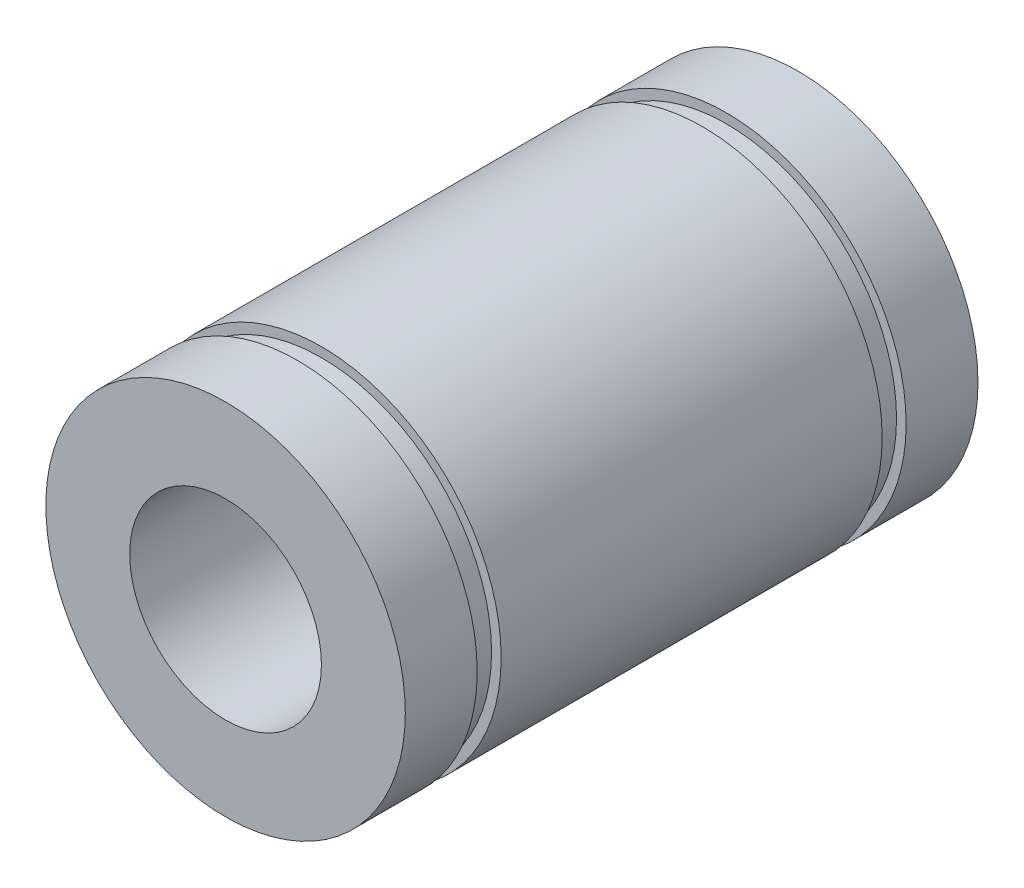
ISO-10303-21;
HEADER;
FILE_DESCRIPTION(('STEP AP214'),'2;1');
FILE_NAME('part.step','',(''),(''),'','','');
FILE_SCHEMA(('AUTOMOTIVE_DESIGN { 1 0 10303 214 1 1 1 1 }'));
ENDSEC;
DATA;
#1=APPLICATION_CONTEXT('core data for automotive mechanical design processes');
#2=APPLICATION_PROTOCOL_DEFINITION('international standard','automotive_design',2000,#1);
#3=PRODUCT_CONTEXT('',#1,'mechanical');
#4=PRODUCT('Part','Part','',(#3));
#5=PRODUCT_RELATED_PRODUCT_CATEGORY('part','',(#4));
#6=PRODUCT_DEFINITION_FORMATION('','',#4);
#7=PRODUCT_DEFINITION_CONTEXT('part definition',#1,'design');
#8=PRODUCT_DEFINITION('design','',#6,#7);
#9=PRODUCT_DEFINITION_SHAPE('','',#8);
#10=(LENGTH_UNIT() NAMED_UNIT(*) SI_UNIT(.MILLI.,.METRE.));
#11=(NAMED_UNIT(*) PLANE_ANGLE_UNIT() SI_UNIT($,.RADIAN.));
#12=(NAMED_UNIT(*) SI_UNIT($,.STERADIAN.) SOLID_ANGLE_UNIT());
#13=UNCERTAINTY_MEASURE_WITH_UNIT(LENGTH_MEASURE(1.E-05),#10,'distance_accuracy_value','');
#14=(GEOMETRIC_REPRESENTATION_CONTEXT(3) GLOBAL_UNCERTAINTY_ASSIGNED_CONTEXT((#13)) GLOBAL_UNIT_ASSIGNED_CONTEXT((#10,
#11,#12)) REPRESENTATION_CONTEXT('',''));
#15=CARTESIAN_POINT('',(0.,0.,0.));
#16=DIRECTION('',(0.,0.,1.));
#17=DIRECTION('',(1.,0.,0.));
#18=AXIS2_PLACEMENT_3D('',#15,#16,#17);
#19=CARTESIAN_POINT('',(0.,0.,11.95));
#20=DIRECTION('',(0.,0.,-1.));
#21=DIRECTION('',(-1.,0.,0.));
#22=AXIS2_PLACEMENT_3D('',#19,#20,#21);
#23=CYLINDRICAL_SURFACE('',#22,7.5);
#24=CARTESIAN_POINT('',(0.,0.,7.95));
#25=DIRECTION('',(0.,0.,1.));
#26=DIRECTION('',(1.,0.,0.));
#27=AXIS2_PLACEMENT_3D('',#24,#25,#26);
#28=CIRCLE('',#27,7.5);
#29=CARTESIAN_POINT('',(7.5,0.,7.95));
#30=VERTEX_POINT('',#29);
#31=EDGE_CURVE('E30',#30,#30,#28,.T.);
#32=ORIENTED_EDGE('',*,*,#31,.F.);
#33=EDGE_LOOP('',(#32));
#34=FACE_BOUND('',#33,.T.);
#35=CARTESIAN_POINT('',(0.,0.,-7.95));
#36=DIRECTION('',(0.,0.,1.));
#37=DIRECTION('',(1.,0.,0.));
#38=AXIS2_PLACEMENT_3D('',#35,#36,#37);
#39=CIRCLE('',#38,7.5);
#40=CARTESIAN_POINT('',(7.5,0.,-7.95));
#41=VERTEX_POINT('',#40);
#42=EDGE_CURVE('E42',#41,#41,#39,.T.);
#43=ORIENTED_EDGE('',*,*,#42,.T.);
#44=EDGE_LOOP('',(#43));
#45=FACE_BOUND('',#44,.T.);
#46=ADVANCED_FACE('F14',(#34,#45),#23,.T.);
#47=CARTESIAN_POINT('',(0.,0.,-8.95));
#48=DIRECTION('',(0.,0.,1.));
#49=DIRECTION('',(1.,0.,0.));
#50=AXIS2_PLACEMENT_3D('',#47,#48,#49);
#51=CIRCLE('',#50,7.5);
#52=CARTESIAN_POINT('',(7.5,0.,-8.95));
#53=VERTEX_POINT('',#52);
#54=EDGE_CURVE('E45',#53,#53,#51,.T.);
#55=ORIENTED_EDGE('',*,*,#54,.F.);
#56=EDGE_LOOP('',(#55));
#57=FACE_BOUND('',#56,.T.);
#58=CARTESIAN_POINT('',(0.,0.,-11.95));
#59=DIRECTION('',(0.,0.,1.));
#60=DIRECTION('',(1.,0.,0.));
#61=AXIS2_PLACEMENT_3D('',#58,#59,#60);
#62=CIRCLE('',#61,7.5);
#63=CARTESIAN_POINT('',(7.5,0.,-11.95));
#64=VERTEX_POINT('',#63);
#65=EDGE_CURVE('E18',#64,#64,#62,.T.);
#66=ORIENTED_EDGE('',*,*,#65,.T.);
#67=EDGE_LOOP('',(#66));
#68=FACE_BOUND('',#67,.T.);
#69=ADVANCED_FACE('F78',(#57,#68),#23,.T.);
#70=CARTESIAN_POINT('',(0.,0.,11.95));
#71=DIRECTION('',(0.,0.,1.));
#72=DIRECTION('',(1.,0.,0.));
#73=AXIS2_PLACEMENT_3D('',#70,#71,#72);
#74=PLANE('',#73);
#75=CARTESIAN_POINT('',(0.,0.,11.95));
#76=DIRECTION('',(0.,0.,1.));
#77=DIRECTION('',(1.,0.,0.));
#78=AXIS2_PLACEMENT_3D('',#75,#76,#77);
#79=CIRCLE('',#78,7.5);
#80=CARTESIAN_POINT('',(7.5,0.,11.95));
#81=VERTEX_POINT('',#80);
#82=EDGE_CURVE('E9',#81,#81,#79,.T.);
#83=ORIENTED_EDGE('',*,*,#82,.T.);
#84=EDGE_LOOP('',(#83));
#85=FACE_BOUND('',#84,.T.);
#86=CARTESIAN_POINT('',(0.,0.,11.95));
#87=DIRECTION('',(0.,0.,1.));
#88=DIRECTION('',(1.,0.,0.));
#89=AXIS2_PLACEMENT_3D('',#86,#87,#88);
#90=CIRCLE('',#89,4.);
#91=CARTESIAN_POINT('',(4.,0.,11.95));
#92=VERTEX_POINT('',#91);
#93=EDGE_CURVE('E25',#92,#92,#90,.T.);
#94=ORIENTED_EDGE('',*,*,#93,.F.);
#95=EDGE_LOOP('',(#94));
#96=FACE_BOUND('',#95,.T.);
#97=ADVANCED_FACE('F83',(#85,#96),#74,.T.);
#98=CARTESIAN_POINT('',(0.,0.,-11.95));
#99=DIRECTION('',(0.,0.,1.));
#100=DIRECTION('',(1.,0.,0.));
#101=AXIS2_PLACEMENT_3D('',#98,#99,#100);
#102=PLANE('',#101);
#103=ORIENTED_EDGE('',*,*,#65,.F.);
#104=EDGE_LOOP('',(#103));
#105=FACE_BOUND('',#104,.T.);
#106=CARTESIAN_POINT('',(0.,0.,-11.95));
#107=DIRECTION('',(0.,0.,1.));
#108=DIRECTION('',(1.,0.,0.));
#109=AXIS2_PLACEMENT_3D('',#106,#107,#108);
#110=CIRCLE('',#109,4.);
#111=CARTESIAN_POINT('',(4.,0.,-11.95));
#112=VERTEX_POINT('',#111);
#113=EDGE_CURVE('E27',#112,#112,#110,.T.);
#114=ORIENTED_EDGE('',*,*,#113,.T.);
#115=EDGE_LOOP('',(#114));
#116=FACE_BOUND('',#115,.T.);
#117=ADVANCED_FACE('F89',(#105,#116),#102,.F.);
#118=CARTESIAN_POINT('',(0.,0.,8.95));
#119=DIRECTION('',(0.,0.,1.));
#120=DIRECTION('',(1.,0.,0.));
#121=AXIS2_PLACEMENT_3D('',#118,#119,#120);
#122=CIRCLE('',#121,7.5);
#123=CARTESIAN_POINT('',(7.5,0.,8.95));
#124=VERTEX_POINT('',#123);
#125=EDGE_CURVE('E33',#124,#124,#122,.T.);
#126=ORIENTED_EDGE('',*,*,#125,.T.);
#127=EDGE_LOOP('',(#126));
#128=FACE_BOUND('',#127,.T.);
#129=ORIENTED_EDGE('',*,*,#82,.F.);
#130=EDGE_LOOP('',(#129));
#131=FACE_BOUND('',#130,.T.);
#132=ADVANCED_FACE('F16',(#128,#131),#23,.T.);
#133=CARTESIAN_POINT('',(0.,0.,11.95));
#134=DIRECTION('',(0.,0.,-1.));
#135=DIRECTION('',(-1.,0.,0.));
#136=AXIS2_PLACEMENT_3D('',#133,#134,#135);
#137=CYLINDRICAL_SURFACE('',#136,4.);
#138=ORIENTED_EDGE('',*,*,#93,.T.);
#139=EDGE_LOOP('',(#138));
#140=FACE_BOUND('',#139,.T.);
#141=ORIENTED_EDGE('',*,*,#113,.F.);
#142=EDGE_LOOP('',(#141));
#143=FACE_BOUND('',#142,.T.);
#144=ADVANCED_FACE('F88',(#140,#143),#137,.F.);
#145=CARTESIAN_POINT('',(0.,0.,7.95));
#146=DIRECTION('',(0.,0.,1.));
#147=DIRECTION('',(1.,0.,0.));
#148=AXIS2_PLACEMENT_3D('',#145,#146,#147);
#149=PLANE('',#148);
#150=CARTESIAN_POINT('',(0.,0.,7.95));
#151=DIRECTION('',(0.,0.,1.));
#152=DIRECTION('',(1.,0.,0.));
#153=AXIS2_PLACEMENT_3D('',#150,#151,#152);
#154=CIRCLE('',#153,7.1);
#155=CARTESIAN_POINT('',(7.1,0.,7.95));
#156=VERTEX_POINT('',#155);
#157=EDGE_CURVE('E36',#156,#156,#154,.T.);
#158=ORIENTED_EDGE('',*,*,#157,.F.);
#159=EDGE_LOOP('',(#158));
#160=FACE_BOUND('',#159,.T.);
#161=ORIENTED_EDGE('',*,*,#31,.T.);
#162=EDGE_LOOP('',(#161));
#163=FACE_BOUND('',#162,.T.);
#164=ADVANCED_FACE('F95',(#160,#163),#149,.T.);
#165=CARTESIAN_POINT('',(0.,0.,8.95));
#166=DIRECTION('',(0.,0.,1.));
#167=DIRECTION('',(1.,0.,0.));
#168=AXIS2_PLACEMENT_3D('',#165,#166,#167);
#169=PLANE('',#168);
#170=CARTESIAN_POINT('',(0.,0.,8.95));
#171=DIRECTION('',(0.,0.,1.));
#172=DIRECTION('',(1.,0.,0.));
#173=AXIS2_PLACEMENT_3D('',#170,#171,#172);
#174=CIRCLE('',#173,7.1);
#175=CARTESIAN_POINT('',(7.1,0.,8.95));
#176=VERTEX_POINT('',#175);
#177=EDGE_CURVE('E39',#176,#176,#174,.T.);
#178=ORIENTED_EDGE('',*,*,#177,.T.);
#179=EDGE_LOOP('',(#178));
#180=FACE_BOUND('',#179,.T.);
#181=ORIENTED_EDGE('',*,*,#125,.F.);
#182=EDGE_LOOP('',(#181));
#183=FACE_BOUND('',#182,.T.);
#184=ADVANCED_FACE('F102',(#180,#183),#169,.F.);
#185=CARTESIAN_POINT('',(0.,0.,7.95));
#186=DIRECTION('',(0.,0.,1.));
#187=DIRECTION('',(1.,0.,0.));
#188=AXIS2_PLACEMENT_3D('',#185,#186,#187);
#189=CYLINDRICAL_SURFACE('',#188,7.1);
#190=ORIENTED_EDGE('',*,*,#157,.T.);
#191=EDGE_LOOP('',(#190));
#192=FACE_BOUND('',#191,.T.);
#193=ORIENTED_EDGE('',*,*,#177,.F.);
#194=EDGE_LOOP('',(#193));
#195=FACE_BOUND('',#194,.T.);
#196=ADVANCED_FACE('F73',(#192,#195),#189,.T.);
#197=CARTESIAN_POINT('',(0.,0.,-7.95));
#198=DIRECTION('',(0.,0.,-1.));
#199=DIRECTION('',(1.,0.,0.));
#200=AXIS2_PLACEMENT_3D('',#197,#198,#199);
#201=PLANE('',#200);
#202=ORIENTED_EDGE('',*,*,#42,.F.);
#203=EDGE_LOOP('',(#202));
#204=FACE_BOUND('',#203,.T.);
#205=CARTESIAN_POINT('',(0.,0.,-7.95));
#206=DIRECTION('',(0.,0.,1.));
#207=DIRECTION('',(1.,0.,0.));
#208=AXIS2_PLACEMENT_3D('',#205,#206,#207);
#209=CIRCLE('',#208,7.1);
#210=CARTESIAN_POINT('',(7.1,0.,-7.95));
#211=VERTEX_POINT('',#210);
#212=EDGE_CURVE('E48',#211,#211,#209,.T.);
#213=ORIENTED_EDGE('',*,*,#212,.T.);
#214=EDGE_LOOP('',(#213));
#215=FACE_BOUND('',#214,.T.);
#216=ADVANCED_FACE('F57',(#204,#215),#201,.T.);
#217=CARTESIAN_POINT('',(0.,0.,-8.95));
#218=DIRECTION('',(0.,0.,-1.));
#219=DIRECTION('',(1.,0.,0.));
#220=AXIS2_PLACEMENT_3D('',#217,#218,#219);
#221=PLANE('',#220);
#222=ORIENTED_EDGE('',*,*,#54,.T.);
#223=EDGE_LOOP('',(#222));
#224=FACE_BOUND('',#223,.T.);
#225=CARTESIAN_POINT('',(0.,0.,-8.95));
#226=DIRECTION('',(0.,0.,1.));
#227=DIRECTION('',(1.,0.,0.));
#228=AXIS2_PLACEMENT_3D('',#225,#226,#227);
#229=CIRCLE('',#228,7.1);
#230=CARTESIAN_POINT('',(7.1,0.,-8.95));
#231=VERTEX_POINT('',#230);
#232=EDGE_CURVE('E51',#231,#231,#229,.T.);
#233=ORIENTED_EDGE('',*,*,#232,.F.);
#234=EDGE_LOOP('',(#233));
#235=FACE_BOUND('',#234,.T.);
#236=ADVANCED_FACE('F62',(#224,#235),#221,.F.);
#237=CARTESIAN_POINT('',(0.,0.,-7.95));
#238=DIRECTION('',(0.,0.,-1.));
#239=DIRECTION('',(-1.,0.,0.));
#240=AXIS2_PLACEMENT_3D('',#237,#238,#239);
#241=CYLINDRICAL_SURFACE('',#240,7.1);
#242=ORIENTED_EDGE('',*,*,#212,.F.);
#243=EDGE_LOOP('',(#242));
#244=FACE_BOUND('',#243,.T.);
#245=ORIENTED_EDGE('',*,*,#232,.T.);
#246=EDGE_LOOP('',(#245));
#247=FACE_BOUND('',#246,.T.);
#248=ADVANCED_FACE('F59',(#244,#247),#241,.T.);
#249=CLOSED_SHELL('',(#46,#69,#97,#117,#132,#144,#164,#184,#196,#216,#236,#248));
#250=MANIFOLD_SOLID_BREP('B1',#249);
#251=ADVANCED_BREP_SHAPE_REPRESENTATION('',(#18,#250),#14);
#252=SHAPE_DEFINITION_REPRESENTATION(#9,#251);
ENDSEC;
END-ISO-10303-21;
